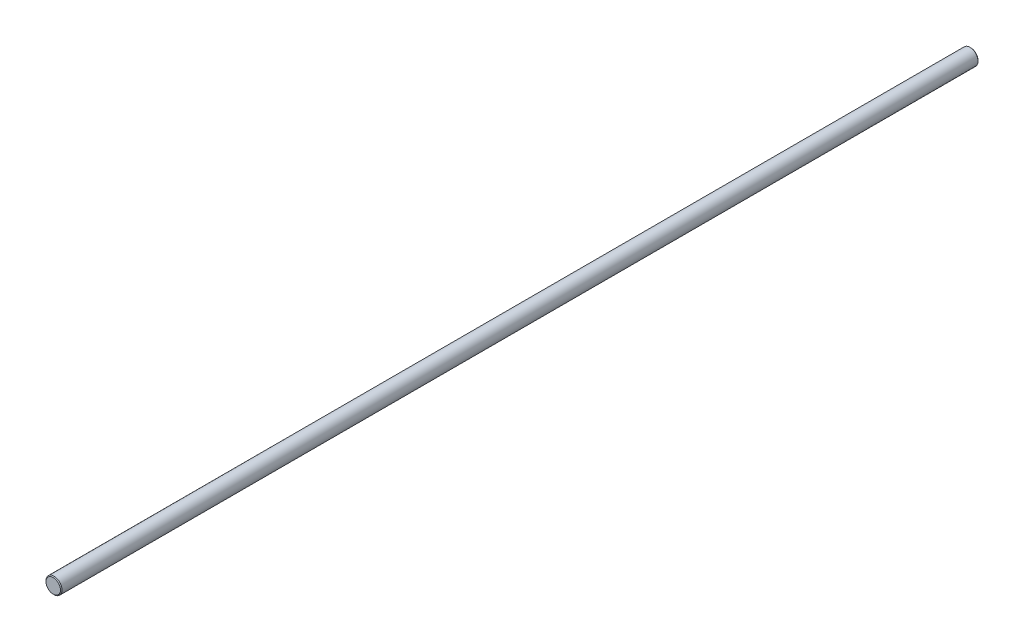
ISO-10303-21;
HEADER;
FILE_DESCRIPTION(('STEP AP214'),'2;1');
FILE_NAME('part.step','',(''),(''),'','','');
FILE_SCHEMA(('AUTOMOTIVE_DESIGN { 1 0 10303 214 1 1 1 1 }'));
ENDSEC;
DATA;
#1=APPLICATION_CONTEXT('core data for automotive mechanical design processes');
#2=APPLICATION_PROTOCOL_DEFINITION('international standard','automotive_design',2000,#1);
#3=PRODUCT_CONTEXT('',#1,'mechanical');
#4=PRODUCT('Part','Part','',(#3));
#5=PRODUCT_RELATED_PRODUCT_CATEGORY('part','',(#4));
#6=PRODUCT_DEFINITION_FORMATION('','',#4);
#7=PRODUCT_DEFINITION_CONTEXT('part definition',#1,'design');
#8=PRODUCT_DEFINITION('design','',#6,#7);
#9=PRODUCT_DEFINITION_SHAPE('','',#8);
#10=(LENGTH_UNIT() NAMED_UNIT(*) SI_UNIT(.MILLI.,.METRE.));
#11=(NAMED_UNIT(*) PLANE_ANGLE_UNIT() SI_UNIT($,.RADIAN.));
#12=(NAMED_UNIT(*) SI_UNIT($,.STERADIAN.) SOLID_ANGLE_UNIT());
#13=UNCERTAINTY_MEASURE_WITH_UNIT(LENGTH_MEASURE(1.E-05),#10,'distance_accuracy_value','');
#14=(GEOMETRIC_REPRESENTATION_CONTEXT(3) GLOBAL_UNCERTAINTY_ASSIGNED_CONTEXT((#13)) GLOBAL_UNIT_ASSIGNED_CONTEXT((#10,
#11,#12)) REPRESENTATION_CONTEXT('',''));
#15=CARTESIAN_POINT('',(0.,0.,0.));
#16=DIRECTION('',(0.,0.,1.));
#17=DIRECTION('',(1.,0.,0.));
#18=AXIS2_PLACEMENT_3D('',#15,#16,#17);
#19=CARTESIAN_POINT('',(0.,0.,228.6));
#20=DIRECTION('',(0.,0.,-1.));
#21=DIRECTION('',(-1.,0.,0.));
#22=AXIS2_PLACEMENT_3D('',#19,#20,#21);
#23=CYLINDRICAL_SURFACE('',#22,4.);
#24=CARTESIAN_POINT('',(0.,0.,-228.2));
#25=DIRECTION('',(0.,0.,1.));
#26=DIRECTION('',(1.,0.,0.));
#27=AXIS2_PLACEMENT_3D('',#24,#25,#26);
#28=CIRCLE('',#27,4.);
#29=CARTESIAN_POINT('',(4.,0.,-228.2));
#30=VERTEX_POINT('',#29);
#31=EDGE_CURVE('E41',#30,#30,#28,.T.);
#32=ORIENTED_EDGE('',*,*,#31,.T.);
#33=EDGE_LOOP('',(#32));
#34=FACE_BOUND('',#33,.T.);
#35=CARTESIAN_POINT('',(0.,0.,228.2));
#36=DIRECTION('',(0.,0.,1.));
#37=DIRECTION('',(1.,0.,0.));
#38=AXIS2_PLACEMENT_3D('',#35,#36,#37);
#39=CIRCLE('',#38,4.);
#40=CARTESIAN_POINT('',(4.,0.,228.2));
#41=VERTEX_POINT('',#40);
#42=EDGE_CURVE('E45',#41,#41,#39,.F.);
#43=ORIENTED_EDGE('',*,*,#42,.T.);
#44=EDGE_LOOP('',(#43));
#45=FACE_BOUND('',#44,.T.);
#46=ADVANCED_FACE('F30',(#34,#45),#23,.T.);
#47=CARTESIAN_POINT('',(0.,0.,228.6));
#48=DIRECTION('',(0.,0.,1.));
#49=DIRECTION('',(1.,0.,0.));
#50=AXIS2_PLACEMENT_3D('',#47,#48,#49);
#51=PLANE('',#50);
#52=CARTESIAN_POINT('',(0.,0.,228.6));
#53=DIRECTION('',(0.,0.,1.));
#54=DIRECTION('',(1.,0.,0.));
#55=AXIS2_PLACEMENT_3D('',#52,#53,#54);
#56=CIRCLE('',#55,3.59999999999999);
#57=CARTESIAN_POINT('',(3.59999999999999,0.,228.6));
#58=VERTEX_POINT('',#57);
#59=EDGE_CURVE('E10',#58,#58,#56,.T.);
#60=ORIENTED_EDGE('',*,*,#59,.T.);
#61=EDGE_LOOP('',(#60));
#62=FACE_BOUND('',#61,.T.);
#63=ADVANCED_FACE('F61',(#62),#51,.T.);
#64=CARTESIAN_POINT('',(0.,0.,-228.6));
#65=DIRECTION('',(0.,0.,1.));
#66=DIRECTION('',(1.,0.,0.));
#67=AXIS2_PLACEMENT_3D('',#64,#65,#66);
#68=PLANE('',#67);
#69=CARTESIAN_POINT('',(0.,0.,-228.6));
#70=DIRECTION('',(0.,0.,1.));
#71=DIRECTION('',(1.,0.,0.));
#72=AXIS2_PLACEMENT_3D('',#69,#70,#71);
#73=CIRCLE('',#72,3.59999999999999);
#74=CARTESIAN_POINT('',(3.59999999999999,0.,-228.6));
#75=VERTEX_POINT('',#74);
#76=EDGE_CURVE('E37',#75,#75,#73,.F.);
#77=ORIENTED_EDGE('',*,*,#76,.T.);
#78=EDGE_LOOP('',(#77));
#79=FACE_BOUND('',#78,.T.);
#80=ADVANCED_FACE('F58',(#79),#68,.F.);
#81=CARTESIAN_POINT('',(0.,0.,-228.2));
#82=DIRECTION('',(0.,0.,1.));
#83=DIRECTION('',(1.,0.,0.));
#84=AXIS2_PLACEMENT_3D('',#81,#82,#83);
#85=CONICAL_SURFACE('',#84,4.,0.78539816339744);
#86=ORIENTED_EDGE('',*,*,#76,.F.);
#87=EDGE_LOOP('',(#86));
#88=FACE_BOUND('',#87,.T.);
#89=ORIENTED_EDGE('',*,*,#31,.F.);
#90=EDGE_LOOP('',(#89));
#91=FACE_BOUND('',#90,.T.);
#92=ADVANCED_FACE('F54',(#88,#91),#85,.T.);
#93=CARTESIAN_POINT('',(0.,0.,228.6));
#94=DIRECTION('',(0.,0.,-1.));
#95=DIRECTION('',(-1.,0.,0.));
#96=AXIS2_PLACEMENT_3D('',#93,#94,#95);
#97=CONICAL_SURFACE('',#96,3.59999999999999,0.785398163397405);
#98=ORIENTED_EDGE('',*,*,#42,.F.);
#99=EDGE_LOOP('',(#98));
#100=FACE_BOUND('',#99,.T.);
#101=ORIENTED_EDGE('',*,*,#59,.F.);
#102=EDGE_LOOP('',(#101));
#103=FACE_BOUND('',#102,.T.);
#104=ADVANCED_FACE('F32',(#100,#103),#97,.T.);
#105=CLOSED_SHELL('',(#46,#63,#80,#92,#104));
#106=MANIFOLD_SOLID_BREP('B2',#105);
#107=ADVANCED_BREP_SHAPE_REPRESENTATION('',(#18,#106),#14);
#108=SHAPE_DEFINITION_REPRESENTATION(#9,#107);
ENDSEC;
END-ISO-10303-21;
